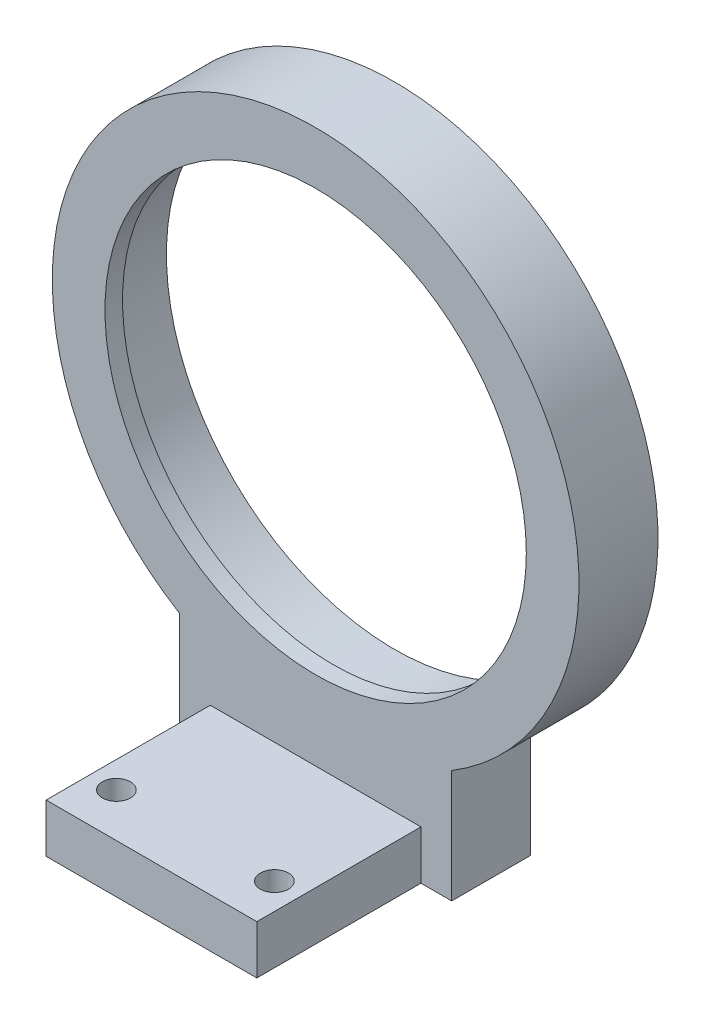
ISO-10303-21;
HEADER;
FILE_DESCRIPTION(('STEP AP214'),'2;1');
FILE_NAME('part.step','',(''),(''),'','','');
FILE_SCHEMA(('AUTOMOTIVE_DESIGN { 1 0 10303 214 1 1 1 1 }'));
ENDSEC;
DATA;
#1=APPLICATION_CONTEXT('core data for automotive mechanical design processes');
#2=APPLICATION_PROTOCOL_DEFINITION('international standard','automotive_design',2000,#1);
#3=PRODUCT_CONTEXT('',#1,'mechanical');
#4=PRODUCT('Part','Part','',(#3));
#5=PRODUCT_RELATED_PRODUCT_CATEGORY('part','',(#4));
#6=PRODUCT_DEFINITION_FORMATION('','',#4);
#7=PRODUCT_DEFINITION_CONTEXT('part definition',#1,'design');
#8=PRODUCT_DEFINITION('design','',#6,#7);
#9=PRODUCT_DEFINITION_SHAPE('','',#8);
#10=(LENGTH_UNIT() NAMED_UNIT(*) SI_UNIT(.MILLI.,.METRE.));
#11=(NAMED_UNIT(*) PLANE_ANGLE_UNIT() SI_UNIT($,.RADIAN.));
#12=(NAMED_UNIT(*) SI_UNIT($,.STERADIAN.) SOLID_ANGLE_UNIT());
#13=UNCERTAINTY_MEASURE_WITH_UNIT(LENGTH_MEASURE(1.E-05),#10,'distance_accuracy_value','');
#14=(GEOMETRIC_REPRESENTATION_CONTEXT(3) GLOBAL_UNCERTAINTY_ASSIGNED_CONTEXT((#13)) GLOBAL_UNIT_ASSIGNED_CONTEXT((#10,
#11,#12)) REPRESENTATION_CONTEXT('',''));
#15=CARTESIAN_POINT('',(0.,0.,0.));
#16=DIRECTION('',(0.,0.,1.));
#17=DIRECTION('',(1.,0.,0.));
#18=AXIS2_PLACEMENT_3D('',#15,#16,#17);
#19=CARTESIAN_POINT('',(0.,0.,7.));
#20=DIRECTION('',(0.,0.,-1.));
#21=DIRECTION('',(-1.,0.,0.));
#22=AXIS2_PLACEMENT_3D('',#19,#20,#21);
#23=CYLINDRICAL_SURFACE('',#22,30.);
#24=CARTESIAN_POINT('',(0.,0.,9.));
#25=DIRECTION('',(0.,0.,1.));
#26=DIRECTION('',(1.,0.,0.));
#27=AXIS2_PLACEMENT_3D('',#24,#25,#26);
#28=CIRCLE('',#27,30.);
#29=CARTESIAN_POINT('',(15.5,-25.6855990780826,9.));
#30=VERTEX_POINT('',#29);
#31=CARTESIAN_POINT('',(-15.5,-25.6855990780826,9.));
#32=VERTEX_POINT('',#31);
#33=EDGE_CURVE('E173',#30,#32,#28,.T.);
#34=ORIENTED_EDGE('',*,*,#33,.F.);
#35=DIRECTION('',(0.,0.,-1.));
#36=VECTOR('',#35,1.);
#37=CARTESIAN_POINT('',(15.5,-25.6855990780826,7.));
#38=LINE('',#37,#36);
#39=CARTESIAN_POINT('',(15.5,-25.6855990780826,0.));
#40=VERTEX_POINT('',#39);
#41=EDGE_CURVE('E45',#30,#40,#38,.T.);
#42=ORIENTED_EDGE('',*,*,#41,.T.);
#43=CARTESIAN_POINT('',(0.,0.,0.));
#44=DIRECTION('',(0.,0.,1.));
#45=DIRECTION('',(1.,0.,0.));
#46=AXIS2_PLACEMENT_3D('',#43,#44,#45);
#47=CIRCLE('',#46,30.);
#48=CARTESIAN_POINT('',(-15.5,-25.6855990780826,0.));
#49=VERTEX_POINT('',#48);
#50=EDGE_CURVE('E108',#40,#49,#47,.T.);
#51=ORIENTED_EDGE('',*,*,#50,.T.);
#52=DIRECTION('',(0.,0.,-1.));
#53=VECTOR('',#52,1.);
#54=CARTESIAN_POINT('',(-15.5,-25.6855990780826,7.));
#55=LINE('',#54,#53);
#56=EDGE_CURVE('E11',#32,#49,#55,.T.);
#57=ORIENTED_EDGE('',*,*,#56,.F.);
#58=EDGE_LOOP('',(#34,#42,#51,#57));
#59=FACE_BOUND('',#58,.T.);
#60=ADVANCED_FACE('F37',(#59),#23,.T.);
#61=CARTESIAN_POINT('',(0.,0.,0.));
#62=DIRECTION('',(0.,0.,1.));
#63=DIRECTION('',(1.,0.,0.));
#64=AXIS2_PLACEMENT_3D('',#61,#62,#63);
#65=PLANE('',#64);
#66=ORIENTED_EDGE('',*,*,#50,.F.);
#67=DIRECTION('',(0.,1.,0.));
#68=VECTOR('',#67,1.);
#69=CARTESIAN_POINT('',(15.5,-38.,0.));
#70=LINE('',#69,#68);
#71=CARTESIAN_POINT('',(15.5,-38.56,0.));
#72=VERTEX_POINT('',#71);
#73=EDGE_CURVE('E61',#72,#40,#70,.T.);
#74=ORIENTED_EDGE('',*,*,#73,.F.);
#75=DIRECTION('',(1.,0.,0.));
#76=VECTOR('',#75,1.);
#77=CARTESIAN_POINT('',(-15.5,-38.56,0.));
#78=LINE('',#77,#76);
#79=CARTESIAN_POINT('',(-15.5,-38.56,0.));
#80=VERTEX_POINT('',#79);
#81=EDGE_CURVE('E106',#80,#72,#78,.T.);
#82=ORIENTED_EDGE('',*,*,#81,.F.);
#83=DIRECTION('',(0.,-1.,0.));
#84=VECTOR('',#83,1.);
#85=CARTESIAN_POINT('',(-15.5,-38.,0.));
#86=LINE('',#85,#84);
#87=EDGE_CURVE('E109',#49,#80,#86,.T.);
#88=ORIENTED_EDGE('',*,*,#87,.F.);
#89=EDGE_LOOP('',(#66,#74,#82,#88));
#90=FACE_BOUND('',#89,.T.);
#91=CARTESIAN_POINT('',(0.,0.,0.));
#92=DIRECTION('',(0.,0.,1.));
#93=DIRECTION('',(1.,0.,0.));
#94=AXIS2_PLACEMENT_3D('',#91,#92,#93);
#95=CIRCLE('',#94,26.);
#96=CARTESIAN_POINT('',(26.,0.,0.));
#97=VERTEX_POINT('',#96);
#98=EDGE_CURVE('E181',#97,#97,#95,.T.);
#99=ORIENTED_EDGE('',*,*,#98,.T.);
#100=EDGE_LOOP('',(#99));
#101=FACE_BOUND('',#100,.T.);
#102=ADVANCED_FACE('F103',(#90,#101),#65,.F.);
#103=CARTESIAN_POINT('',(-15.5,-38.,7.));
#104=DIRECTION('',(1.,0.,0.));
#105=DIRECTION('',(0.,0.,-1.));
#106=AXIS2_PLACEMENT_3D('',#103,#104,#105);
#107=PLANE('',#106);
#108=ORIENTED_EDGE('',*,*,#87,.T.);
#109=DIRECTION('',(0.,0.,-1.));
#110=VECTOR('',#109,1.);
#111=CARTESIAN_POINT('',(-15.5,-38.56,9.));
#112=LINE('',#111,#110);
#113=CARTESIAN_POINT('',(-15.5,-38.56,9.));
#114=VERTEX_POINT('',#113);
#115=EDGE_CURVE('E125',#114,#80,#112,.T.);
#116=ORIENTED_EDGE('',*,*,#115,.F.);
#117=DIRECTION('',(0.,-1.,0.));
#118=VECTOR('',#117,1.);
#119=CARTESIAN_POINT('',(-15.5,-25.6855990780826,9.));
#120=LINE('',#119,#118);
#121=EDGE_CURVE('E154',#32,#114,#120,.T.);
#122=ORIENTED_EDGE('',*,*,#121,.F.);
#123=ORIENTED_EDGE('',*,*,#56,.T.);
#124=EDGE_LOOP('',(#108,#116,#122,#123));
#125=FACE_BOUND('',#124,.T.);
#126=ADVANCED_FACE('F208',(#125),#107,.F.);
#127=CARTESIAN_POINT('',(15.5,-38.,7.));
#128=DIRECTION('',(-1.,0.,0.));
#129=DIRECTION('',(0.,0.,1.));
#130=AXIS2_PLACEMENT_3D('',#127,#128,#129);
#131=PLANE('',#130);
#132=ORIENTED_EDGE('',*,*,#73,.T.);
#133=ORIENTED_EDGE('',*,*,#41,.F.);
#134=DIRECTION('',(0.,1.,0.));
#135=VECTOR('',#134,1.);
#136=CARTESIAN_POINT('',(15.5,-38.,9.));
#137=LINE('',#136,#135);
#138=CARTESIAN_POINT('',(15.5,-38.56,9.));
#139=VERTEX_POINT('',#138);
#140=EDGE_CURVE('E115',#139,#30,#137,.T.);
#141=ORIENTED_EDGE('',*,*,#140,.F.);
#142=DIRECTION('',(0.,0.,1.));
#143=VECTOR('',#142,1.);
#144=CARTESIAN_POINT('',(15.5,-38.56,0.));
#145=LINE('',#144,#143);
#146=EDGE_CURVE('E112',#72,#139,#145,.T.);
#147=ORIENTED_EDGE('',*,*,#146,.F.);
#148=EDGE_LOOP('',(#132,#133,#141,#147));
#149=FACE_BOUND('',#148,.T.);
#150=ADVANCED_FACE('F113',(#149),#131,.F.);
#151=CARTESIAN_POINT('',(0.,0.,7.));
#152=DIRECTION('',(0.,0.,-1.));
#153=DIRECTION('',(-1.,0.,0.));
#154=AXIS2_PLACEMENT_3D('',#151,#152,#153);
#155=CYLINDRICAL_SURFACE('',#154,26.);
#156=CARTESIAN_POINT('',(0.,0.,7.));
#157=DIRECTION('',(0.,0.,1.));
#158=DIRECTION('',(1.,0.,0.));
#159=AXIS2_PLACEMENT_3D('',#156,#157,#158);
#160=CIRCLE('',#159,26.);
#161=CARTESIAN_POINT('',(26.,0.,7.));
#162=VERTEX_POINT('',#161);
#163=EDGE_CURVE('E178',#162,#162,#160,.T.);
#164=ORIENTED_EDGE('',*,*,#163,.T.);
#165=EDGE_LOOP('',(#164));
#166=FACE_BOUND('',#165,.T.);
#167=ORIENTED_EDGE('',*,*,#98,.F.);
#168=EDGE_LOOP('',(#167));
#169=FACE_BOUND('',#168,.T.);
#170=ADVANCED_FACE('F251',(#166,#169),#155,.F.);
#171=CARTESIAN_POINT('',(0.,0.,9.));
#172=DIRECTION('',(0.,0.,1.));
#173=DIRECTION('',(1.,0.,0.));
#174=AXIS2_PLACEMENT_3D('',#171,#172,#173);
#175=PLANE('',#174);
#176=ORIENTED_EDGE('',*,*,#33,.T.);
#177=ORIENTED_EDGE('',*,*,#121,.T.);
#178=DIRECTION('',(-1.,0.,0.));
#179=VECTOR('',#178,1.);
#180=CARTESIAN_POINT('',(-12.,-38.56,9.));
#181=LINE('',#180,#179);
#182=CARTESIAN_POINT('',(-12.,-38.56,9.));
#183=VERTEX_POINT('',#182);
#184=EDGE_CURVE('E140',#183,#114,#181,.T.);
#185=ORIENTED_EDGE('',*,*,#184,.F.);
#186=DIRECTION('',(0.,1.,0.));
#187=VECTOR('',#186,1.);
#188=CARTESIAN_POINT('',(-12.,-33.,9.));
#189=LINE('',#188,#187);
#190=CARTESIAN_POINT('',(-12.,-33.,9.));
#191=VERTEX_POINT('',#190);
#192=EDGE_CURVE('E53',#183,#191,#189,.T.);
#193=ORIENTED_EDGE('',*,*,#192,.T.);
#194=DIRECTION('',(1.,0.,0.));
#195=VECTOR('',#194,1.);
#196=CARTESIAN_POINT('',(12.,-33.,9.));
#197=LINE('',#196,#195);
#198=CARTESIAN_POINT('',(12.,-33.,9.));
#199=VERTEX_POINT('',#198);
#200=EDGE_CURVE('E150',#191,#199,#197,.T.);
#201=ORIENTED_EDGE('',*,*,#200,.T.);
#202=DIRECTION('',(0.,-1.,0.));
#203=VECTOR('',#202,1.);
#204=CARTESIAN_POINT('',(12.,-38.,9.));
#205=LINE('',#204,#203);
#206=CARTESIAN_POINT('',(12.,-38.56,9.));
#207=VERTEX_POINT('',#206);
#208=EDGE_CURVE('E147',#199,#207,#205,.T.);
#209=ORIENTED_EDGE('',*,*,#208,.T.);
#210=DIRECTION('',(-1.,0.,0.));
#211=VECTOR('',#210,1.);
#212=CARTESIAN_POINT('',(15.5,-38.56,9.));
#213=LINE('',#212,#211);
#214=EDGE_CURVE('E119',#139,#207,#213,.T.);
#215=ORIENTED_EDGE('',*,*,#214,.F.);
#216=ORIENTED_EDGE('',*,*,#140,.T.);
#217=EDGE_LOOP('',(#176,#177,#185,#193,#201,#209,#215,#216));
#218=FACE_BOUND('',#217,.T.);
#219=CARTESIAN_POINT('',(0.,0.,9.));
#220=DIRECTION('',(0.,0.,1.));
#221=DIRECTION('',(1.,0.,0.));
#222=AXIS2_PLACEMENT_3D('',#219,#220,#221);
#223=CIRCLE('',#222,24.);
#224=CARTESIAN_POINT('',(24.,0.,9.));
#225=VERTEX_POINT('',#224);
#226=EDGE_CURVE('E170',#225,#225,#223,.T.);
#227=ORIENTED_EDGE('',*,*,#226,.F.);
#228=EDGE_LOOP('',(#227));
#229=FACE_BOUND('',#228,.T.);
#230=ADVANCED_FACE('F212',(#218,#229),#175,.T.);
#231=CARTESIAN_POINT('',(0.,0.,7.));
#232=DIRECTION('',(0.,0.,1.));
#233=DIRECTION('',(1.,0.,0.));
#234=AXIS2_PLACEMENT_3D('',#231,#232,#233);
#235=PLANE('',#234);
#236=ORIENTED_EDGE('',*,*,#163,.F.);
#237=EDGE_LOOP('',(#236));
#238=FACE_BOUND('',#237,.T.);
#239=CARTESIAN_POINT('',(0.,0.,7.));
#240=DIRECTION('',(0.,0.,1.));
#241=DIRECTION('',(1.,0.,0.));
#242=AXIS2_PLACEMENT_3D('',#239,#240,#241);
#243=CIRCLE('',#242,24.);
#244=CARTESIAN_POINT('',(24.,0.,7.));
#245=VERTEX_POINT('',#244);
#246=EDGE_CURVE('E169',#245,#245,#243,.T.);
#247=ORIENTED_EDGE('',*,*,#246,.T.);
#248=EDGE_LOOP('',(#247));
#249=FACE_BOUND('',#248,.T.);
#250=ADVANCED_FACE('F247',(#238,#249),#235,.F.);
#251=CARTESIAN_POINT('',(0.,0.,9.));
#252=DIRECTION('',(0.,0.,-1.));
#253=DIRECTION('',(-1.,0.,0.));
#254=AXIS2_PLACEMENT_3D('',#251,#252,#253);
#255=CYLINDRICAL_SURFACE('',#254,24.);
#256=ORIENTED_EDGE('',*,*,#226,.T.);
#257=EDGE_LOOP('',(#256));
#258=FACE_BOUND('',#257,.T.);
#259=ORIENTED_EDGE('',*,*,#246,.F.);
#260=EDGE_LOOP('',(#259));
#261=FACE_BOUND('',#260,.T.);
#262=ADVANCED_FACE('F244',(#258,#261),#255,.F.);
#263=CARTESIAN_POINT('',(-12.,-33.,27.7));
#264=DIRECTION('',(1.,0.,0.));
#265=DIRECTION('',(0.,0.,-1.));
#266=AXIS2_PLACEMENT_3D('',#263,#264,#265);
#267=PLANE('',#266);
#268=DIRECTION('',(0.,0.,-1.));
#269=VECTOR('',#268,1.);
#270=CARTESIAN_POINT('',(-12.,-33.,27.7));
#271=LINE('',#270,#269);
#272=CARTESIAN_POINT('',(-12.,-33.,27.7));
#273=VERTEX_POINT('',#272);
#274=EDGE_CURVE('E163',#273,#191,#271,.T.);
#275=ORIENTED_EDGE('',*,*,#274,.T.);
#276=ORIENTED_EDGE('',*,*,#192,.F.);
#277=DIRECTION('',(0.,0.,-1.));
#278=VECTOR('',#277,1.);
#279=CARTESIAN_POINT('',(-12.,-38.56,27.7));
#280=LINE('',#279,#278);
#281=CARTESIAN_POINT('',(-12.,-38.56,27.7));
#282=VERTEX_POINT('',#281);
#283=EDGE_CURVE('E137',#282,#183,#280,.T.);
#284=ORIENTED_EDGE('',*,*,#283,.F.);
#285=DIRECTION('',(0.,-1.,0.));
#286=VECTOR('',#285,1.);
#287=CARTESIAN_POINT('',(-12.,-33.,27.7));
#288=LINE('',#287,#286);
#289=EDGE_CURVE('E152',#273,#282,#288,.T.);
#290=ORIENTED_EDGE('',*,*,#289,.F.);
#291=EDGE_LOOP('',(#275,#276,#284,#290));
#292=FACE_BOUND('',#291,.T.);
#293=ADVANCED_FACE('F227',(#292),#267,.F.);
#294=CARTESIAN_POINT('',(12.,-33.,27.7));
#295=DIRECTION('',(-1.,0.,0.));
#296=DIRECTION('',(0.,-1.,0.));
#297=AXIS2_PLACEMENT_3D('',#294,#295,#296);
#298=PLANE('',#297);
#299=DIRECTION('',(0.,1.,0.));
#300=VECTOR('',#299,1.);
#301=CARTESIAN_POINT('',(12.,-33.,27.7));
#302=LINE('',#301,#300);
#303=CARTESIAN_POINT('',(12.,-38.56,27.7));
#304=VERTEX_POINT('',#303);
#305=CARTESIAN_POINT('',(12.,-33.,27.7));
#306=VERTEX_POINT('',#305);
#307=EDGE_CURVE('E159',#304,#306,#302,.T.);
#308=ORIENTED_EDGE('',*,*,#307,.F.);
#309=DIRECTION('',(0.,0.,1.));
#310=VECTOR('',#309,1.);
#311=CARTESIAN_POINT('',(12.,-38.56,9.));
#312=LINE('',#311,#310);
#313=EDGE_CURVE('E131',#207,#304,#312,.T.);
#314=ORIENTED_EDGE('',*,*,#313,.F.);
#315=ORIENTED_EDGE('',*,*,#208,.F.);
#316=DIRECTION('',(0.,0.,-1.));
#317=VECTOR('',#316,1.);
#318=CARTESIAN_POINT('',(12.,-33.,27.7));
#319=LINE('',#318,#317);
#320=EDGE_CURVE('E166',#306,#199,#319,.T.);
#321=ORIENTED_EDGE('',*,*,#320,.F.);
#322=EDGE_LOOP('',(#308,#314,#315,#321));
#323=FACE_BOUND('',#322,.T.);
#324=ADVANCED_FACE('F218',(#323),#298,.F.);
#325=CARTESIAN_POINT('',(-12.,-33.,27.7));
#326=DIRECTION('',(0.,-1.,0.));
#327=DIRECTION('',(0.,0.,-1.));
#328=AXIS2_PLACEMENT_3D('',#325,#326,#327);
#329=PLANE('',#328);
#330=CARTESIAN_POINT('',(-9.,-33.,22.7));
#331=DIRECTION('',(0.,1.,0.));
#332=DIRECTION('',(0.,0.,1.));
#333=AXIS2_PLACEMENT_3D('',#330,#331,#332);
#334=CIRCLE('',#333,1.6);
#335=CARTESIAN_POINT('',(-9.,-33.,24.3));
#336=VERTEX_POINT('',#335);
#337=EDGE_CURVE('E144',#336,#336,#334,.T.);
#338=ORIENTED_EDGE('',*,*,#337,.F.);
#339=EDGE_LOOP('',(#338));
#340=FACE_BOUND('',#339,.T.);
#341=CARTESIAN_POINT('',(9.,-33.,22.7));
#342=DIRECTION('',(0.,1.,0.));
#343=DIRECTION('',(0.,0.,1.));
#344=AXIS2_PLACEMENT_3D('',#341,#342,#343);
#345=CIRCLE('',#344,1.6);
#346=CARTESIAN_POINT('',(9.,-33.,24.3));
#347=VERTEX_POINT('',#346);
#348=EDGE_CURVE('E143',#347,#347,#345,.T.);
#349=ORIENTED_EDGE('',*,*,#348,.F.);
#350=EDGE_LOOP('',(#349));
#351=FACE_BOUND('',#350,.T.);
#352=ORIENTED_EDGE('',*,*,#320,.T.);
#353=ORIENTED_EDGE('',*,*,#200,.F.);
#354=ORIENTED_EDGE('',*,*,#274,.F.);
#355=DIRECTION('',(-1.,0.,0.));
#356=VECTOR('',#355,1.);
#357=CARTESIAN_POINT('',(-12.,-33.,27.7));
#358=LINE('',#357,#356);
#359=EDGE_CURVE('E161',#306,#273,#358,.T.);
#360=ORIENTED_EDGE('',*,*,#359,.F.);
#361=EDGE_LOOP('',(#352,#353,#354,#360));
#362=FACE_BOUND('',#361,.T.);
#363=ADVANCED_FACE('F229',(#340,#351,#362),#329,.F.);
#364=CARTESIAN_POINT('',(0.,0.,27.7));
#365=DIRECTION('',(0.,0.,1.));
#366=DIRECTION('',(1.,0.,0.));
#367=AXIS2_PLACEMENT_3D('',#364,#365,#366);
#368=PLANE('',#367);
#369=ORIENTED_EDGE('',*,*,#289,.T.);
#370=DIRECTION('',(-1.,0.,0.));
#371=VECTOR('',#370,1.);
#372=CARTESIAN_POINT('',(12.,-38.56,27.7));
#373=LINE('',#372,#371);
#374=EDGE_CURVE('E134',#304,#282,#373,.T.);
#375=ORIENTED_EDGE('',*,*,#374,.F.);
#376=ORIENTED_EDGE('',*,*,#307,.T.);
#377=ORIENTED_EDGE('',*,*,#359,.T.);
#378=EDGE_LOOP('',(#369,#375,#376,#377));
#379=FACE_BOUND('',#378,.T.);
#380=ADVANCED_FACE('F222',(#379),#368,.T.);
#381=CARTESIAN_POINT('',(9.,-38.,22.7));
#382=DIRECTION('',(0.,1.,0.));
#383=DIRECTION('',(0.,0.,1.));
#384=AXIS2_PLACEMENT_3D('',#381,#382,#383);
#385=CYLINDRICAL_SURFACE('',#384,1.6);
#386=ORIENTED_EDGE('',*,*,#348,.T.);
#387=EDGE_LOOP('',(#386));
#388=FACE_BOUND('',#387,.T.);
#389=CARTESIAN_POINT('',(9.,-38.56,22.7));
#390=DIRECTION('',(0.,-1.,0.));
#391=DIRECTION('',(0.,0.,-1.));
#392=AXIS2_PLACEMENT_3D('',#389,#390,#391);
#393=CIRCLE('',#392,1.6);
#394=CARTESIAN_POINT('',(9.,-38.56,21.1));
#395=VERTEX_POINT('',#394);
#396=EDGE_CURVE('E40',#395,#395,#393,.T.);
#397=ORIENTED_EDGE('',*,*,#396,.T.);
#398=EDGE_LOOP('',(#397));
#399=FACE_BOUND('',#398,.T.);
#400=ADVANCED_FACE('F197',(#388,#399),#385,.F.);
#401=CARTESIAN_POINT('',(-9.,-38.,22.7));
#402=DIRECTION('',(0.,1.,0.));
#403=DIRECTION('',(0.,0.,1.));
#404=AXIS2_PLACEMENT_3D('',#401,#402,#403);
#405=CYLINDRICAL_SURFACE('',#404,1.6);
#406=ORIENTED_EDGE('',*,*,#337,.T.);
#407=EDGE_LOOP('',(#406));
#408=FACE_BOUND('',#407,.T.);
#409=CARTESIAN_POINT('',(-9.,-38.56,22.7));
#410=DIRECTION('',(0.,-1.,0.));
#411=DIRECTION('',(0.,0.,-1.));
#412=AXIS2_PLACEMENT_3D('',#409,#410,#411);
#413=CIRCLE('',#412,1.6);
#414=CARTESIAN_POINT('',(-9.,-38.56,21.1));
#415=VERTEX_POINT('',#414);
#416=EDGE_CURVE('E128',#415,#415,#413,.T.);
#417=ORIENTED_EDGE('',*,*,#416,.T.);
#418=EDGE_LOOP('',(#417));
#419=FACE_BOUND('',#418,.T.);
#420=ADVANCED_FACE('F189',(#408,#419),#405,.F.);
#421=CARTESIAN_POINT('',(0.,-38.56,0.));
#422=DIRECTION('',(0.,-1.,0.));
#423=DIRECTION('',(0.,0.,-1.));
#424=AXIS2_PLACEMENT_3D('',#421,#422,#423);
#425=PLANE('',#424);
#426=ORIENTED_EDGE('',*,*,#396,.F.);
#427=EDGE_LOOP('',(#426));
#428=FACE_BOUND('',#427,.T.);
#429=ORIENTED_EDGE('',*,*,#416,.F.);
#430=EDGE_LOOP('',(#429));
#431=FACE_BOUND('',#430,.T.);
#432=ORIENTED_EDGE('',*,*,#81,.T.);
#433=ORIENTED_EDGE('',*,*,#146,.T.);
#434=ORIENTED_EDGE('',*,*,#214,.T.);
#435=ORIENTED_EDGE('',*,*,#313,.T.);
#436=ORIENTED_EDGE('',*,*,#374,.T.);
#437=ORIENTED_EDGE('',*,*,#283,.T.);
#438=ORIENTED_EDGE('',*,*,#184,.T.);
#439=ORIENTED_EDGE('',*,*,#115,.T.);
#440=EDGE_LOOP('',(#432,#433,#434,#435,#436,#437,#438,#439));
#441=FACE_BOUND('',#440,.T.);
#442=ADVANCED_FACE('F122',(#428,#431,#441),#425,.T.);
#443=CLOSED_SHELL('',(#60,#102,#126,#150,#170,#230,#250,#262,#293,#324,#363,#380,#400,#420,#442));
#444=MANIFOLD_SOLID_BREP('B2',#443);
#445=ADVANCED_BREP_SHAPE_REPRESENTATION('',(#18,#444),#14);
#446=SHAPE_DEFINITION_REPRESENTATION(#9,#445);
ENDSEC;
END-ISO-10303-21;
